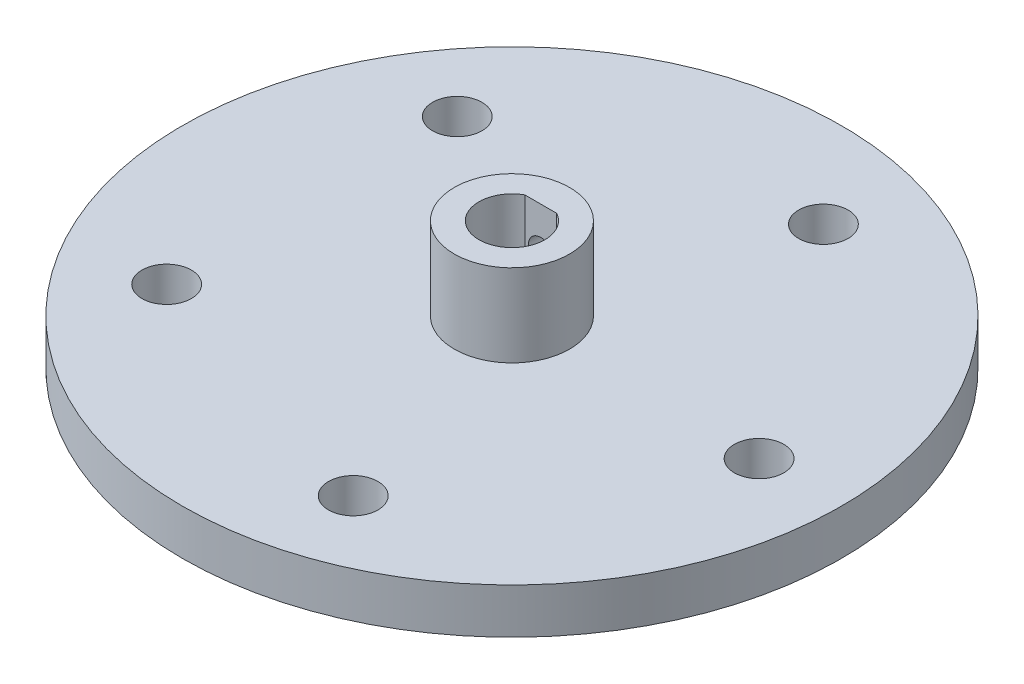
ISO-10303-21;
HEADER;
FILE_DESCRIPTION(('STEP AP214'),'2;1');
FILE_NAME('part.step','',(''),(''),'','','');
FILE_SCHEMA(('AUTOMOTIVE_DESIGN { 1 0 10303 214 1 1 1 1 }'));
ENDSEC;
DATA;
#1=APPLICATION_CONTEXT('core data for automotive mechanical design processes');
#2=APPLICATION_PROTOCOL_DEFINITION('international standard','automotive_design',2000,#1);
#3=PRODUCT_CONTEXT('',#1,'mechanical');
#4=PRODUCT('Part','Part','',(#3));
#5=PRODUCT_RELATED_PRODUCT_CATEGORY('part','',(#4));
#6=PRODUCT_DEFINITION_FORMATION('','',#4);
#7=PRODUCT_DEFINITION_CONTEXT('part definition',#1,'design');
#8=PRODUCT_DEFINITION('design','',#6,#7);
#9=PRODUCT_DEFINITION_SHAPE('','',#8);
#10=(LENGTH_UNIT() NAMED_UNIT(*) SI_UNIT(.MILLI.,.METRE.));
#11=(NAMED_UNIT(*) PLANE_ANGLE_UNIT() SI_UNIT($,.RADIAN.));
#12=(NAMED_UNIT(*) SI_UNIT($,.STERADIAN.) SOLID_ANGLE_UNIT());
#13=UNCERTAINTY_MEASURE_WITH_UNIT(LENGTH_MEASURE(1.E-05),#10,'distance_accuracy_value','');
#14=(GEOMETRIC_REPRESENTATION_CONTEXT(3) GLOBAL_UNCERTAINTY_ASSIGNED_CONTEXT((#13)) GLOBAL_UNIT_ASSIGNED_CONTEXT((#10,
#11,#12)) REPRESENTATION_CONTEXT('',''));
#15=CARTESIAN_POINT('',(0.,0.,0.));
#16=DIRECTION('',(0.,0.,1.));
#17=DIRECTION('',(1.,0.,0.));
#18=AXIS2_PLACEMENT_3D('',#15,#16,#17);
#19=CARTESIAN_POINT('',(0.,5.5,0.));
#20=DIRECTION('',(0.,-1.,0.));
#21=DIRECTION('',(0.,0.,-1.));
#22=AXIS2_PLACEMENT_3D('',#19,#20,#21);
#23=CYLINDRICAL_SURFACE('',#22,40.);
#24=CARTESIAN_POINT('',(0.,5.5,0.));
#25=DIRECTION('',(0.,1.,0.));
#26=DIRECTION('',(0.,0.,1.));
#27=AXIS2_PLACEMENT_3D('',#24,#25,#26);
#28=CIRCLE('',#27,40.);
#29=CARTESIAN_POINT('',(0.,5.5,40.));
#30=VERTEX_POINT('',#29);
#31=EDGE_CURVE('E11',#30,#30,#28,.T.);
#32=ORIENTED_EDGE('',*,*,#31,.F.);
#33=EDGE_LOOP('',(#32));
#34=FACE_BOUND('',#33,.T.);
#35=CARTESIAN_POINT('',(0.,0.,0.));
#36=DIRECTION('',(0.,1.,0.));
#37=DIRECTION('',(0.,0.,1.));
#38=AXIS2_PLACEMENT_3D('',#35,#36,#37);
#39=CIRCLE('',#38,40.);
#40=CARTESIAN_POINT('',(0.,0.,40.));
#41=VERTEX_POINT('',#40);
#42=EDGE_CURVE('E45',#41,#41,#39,.T.);
#43=ORIENTED_EDGE('',*,*,#42,.T.);
#44=EDGE_LOOP('',(#43));
#45=FACE_BOUND('',#44,.T.);
#46=ADVANCED_FACE('F37',(#34,#45),#23,.T.);
#47=CARTESIAN_POINT('',(0.,5.5,0.));
#48=DIRECTION('',(0.,1.,0.));
#49=DIRECTION('',(0.,0.,1.));
#50=AXIS2_PLACEMENT_3D('',#47,#48,#49);
#51=PLANE('',#50);
#52=CARTESIAN_POINT('',(0.,5.5,0.));
#53=DIRECTION('',(0.,1.,0.));
#54=DIRECTION('',(0.,0.,1.));
#55=AXIS2_PLACEMENT_3D('',#52,#53,#54);
#56=CIRCLE('',#55,7.);
#57=CARTESIAN_POINT('',(0.,5.5,7.));
#58=VERTEX_POINT('',#57);
#59=EDGE_CURVE('E92',#58,#58,#56,.T.);
#60=ORIENTED_EDGE('',*,*,#59,.F.);
#61=EDGE_LOOP('',(#60));
#62=FACE_BOUND('',#61,.T.);
#63=CARTESIAN_POINT('',(9.27050983124834,5.5,-28.5316954888546));
#64=DIRECTION('',(0.,1.,0.));
#65=DIRECTION('',(0.951056516295155,0.,0.309016994374945));
#66=AXIS2_PLACEMENT_3D('',#63,#64,#65);
#67=CIRCLE('',#66,3.);
#68=CARTESIAN_POINT('',(12.1236793801338,5.5,-27.6046445057298));
#69=VERTEX_POINT('',#68);
#70=EDGE_CURVE('E103',#69,#69,#67,.T.);
#71=ORIENTED_EDGE('',*,*,#70,.F.);
#72=EDGE_LOOP('',(#71));
#73=FACE_BOUND('',#72,.T.);
#74=CARTESIAN_POINT('',(-24.2705098312485,5.5,-17.6335575687741));
#75=DIRECTION('',(0.,1.,0.));
#76=DIRECTION('',(0.587785252292469,0.,-0.809016994374951));
#77=AXIS2_PLACEMENT_3D('',#74,#75,#76);
#78=CIRCLE('',#77,3.);
#79=CARTESIAN_POINT('',(-22.5071540743711,5.5,-20.0606085518989));
#80=VERTEX_POINT('',#79);
#81=EDGE_CURVE('E109',#80,#80,#78,.T.);
#82=ORIENTED_EDGE('',*,*,#81,.F.);
#83=EDGE_LOOP('',(#82));
#84=FACE_BOUND('',#83,.T.);
#85=CARTESIAN_POINT('',(-24.2705098312483,5.5,17.6335575687744));
#86=DIRECTION('',(0.,1.,0.));
#87=DIRECTION('',(-0.58778525229248,0.,-0.809016994374942));
#88=AXIS2_PLACEMENT_3D('',#85,#86,#87);
#89=CIRCLE('',#88,3.);
#90=CARTESIAN_POINT('',(-26.0338655881257,5.5,15.2065065856496));
#91=VERTEX_POINT('',#90);
#92=EDGE_CURVE('E115',#91,#91,#89,.T.);
#93=ORIENTED_EDGE('',*,*,#92,.F.);
#94=EDGE_LOOP('',(#93));
#95=FACE_BOUND('',#94,.T.);
#96=CARTESIAN_POINT('',(9.27050983124875,5.5,28.5316954888545));
#97=DIRECTION('',(0.,1.,0.));
#98=DIRECTION('',(-0.95105651629515,0.,0.309016994374958));
#99=AXIS2_PLACEMENT_3D('',#96,#97,#98);
#100=CIRCLE('',#99,3.);
#101=CARTESIAN_POINT('',(6.41734028236329,5.5,29.4587464719794));
#102=VERTEX_POINT('',#101);
#103=EDGE_CURVE('E96',#102,#102,#100,.T.);
#104=ORIENTED_EDGE('',*,*,#103,.F.);
#105=EDGE_LOOP('',(#104));
#106=FACE_BOUND('',#105,.T.);
#107=CARTESIAN_POINT('',(30.,5.5,0.));
#108=DIRECTION('',(0.,1.,0.));
#109=DIRECTION('',(0.,0.,1.));
#110=AXIS2_PLACEMENT_3D('',#107,#108,#109);
#111=CIRCLE('',#110,3.);
#112=CARTESIAN_POINT('',(30.,5.5,3.));
#113=VERTEX_POINT('',#112);
#114=EDGE_CURVE('E102',#113,#113,#111,.T.);
#115=ORIENTED_EDGE('',*,*,#114,.F.);
#116=EDGE_LOOP('',(#115));
#117=FACE_BOUND('',#116,.T.);
#118=ORIENTED_EDGE('',*,*,#31,.T.);
#119=EDGE_LOOP('',(#118));
#120=FACE_BOUND('',#119,.T.);
#121=ADVANCED_FACE('F134',(#62,#73,#84,#95,#106,#117,#120),#51,.T.);
#122=CARTESIAN_POINT('',(0.,0.,0.));
#123=DIRECTION('',(0.,1.,0.));
#124=DIRECTION('',(0.,0.,1.));
#125=AXIS2_PLACEMENT_3D('',#122,#123,#124);
#126=PLANE('',#125);
#127=CARTESIAN_POINT('',(0.,0.,0.));
#128=DIRECTION('',(0.,1.,0.));
#129=DIRECTION('',(0.,0.,1.));
#130=AXIS2_PLACEMENT_3D('',#127,#128,#129);
#131=CIRCLE('',#130,4.);
#132=CARTESIAN_POINT('',(-1.93649167310371,0.,-3.5));
#133=VERTEX_POINT('',#132);
#134=CARTESIAN_POINT('',(1.93649167310371,0.,-3.5));
#135=VERTEX_POINT('',#134);
#136=EDGE_CURVE('E69',#133,#135,#131,.T.);
#137=ORIENTED_EDGE('',*,*,#136,.T.);
#138=DIRECTION('',(-1.,0.,0.));
#139=VECTOR('',#138,1.);
#140=CARTESIAN_POINT('',(0.,0.,-3.5));
#141=LINE('',#140,#139);
#142=EDGE_CURVE('E67',#135,#133,#141,.T.);
#143=ORIENTED_EDGE('',*,*,#142,.T.);
#144=EDGE_LOOP('',(#137,#143));
#145=FACE_BOUND('',#144,.T.);
#146=CARTESIAN_POINT('',(9.27050983124834,0.,-28.5316954888546));
#147=DIRECTION('',(0.,1.,0.));
#148=DIRECTION('',(0.951056516295155,0.,0.309016994374945));
#149=AXIS2_PLACEMENT_3D('',#146,#147,#148);
#150=CIRCLE('',#149,3.);
#151=CARTESIAN_POINT('',(12.1236793801338,0.,-27.6046445057298));
#152=VERTEX_POINT('',#151);
#153=EDGE_CURVE('E99',#152,#152,#150,.T.);
#154=ORIENTED_EDGE('',*,*,#153,.T.);
#155=EDGE_LOOP('',(#154));
#156=FACE_BOUND('',#155,.T.);
#157=CARTESIAN_POINT('',(-24.2705098312485,0.,-17.6335575687741));
#158=DIRECTION('',(0.,1.,0.));
#159=DIRECTION('',(0.587785252292469,0.,-0.809016994374951));
#160=AXIS2_PLACEMENT_3D('',#157,#158,#159);
#161=CIRCLE('',#160,3.);
#162=CARTESIAN_POINT('',(-22.5071540743711,0.,-20.0606085518989));
#163=VERTEX_POINT('',#162);
#164=EDGE_CURVE('E106',#163,#163,#161,.T.);
#165=ORIENTED_EDGE('',*,*,#164,.T.);
#166=EDGE_LOOP('',(#165));
#167=FACE_BOUND('',#166,.T.);
#168=CARTESIAN_POINT('',(-24.2705098312483,0.,17.6335575687744));
#169=DIRECTION('',(0.,1.,0.));
#170=DIRECTION('',(-0.58778525229248,0.,-0.809016994374942));
#171=AXIS2_PLACEMENT_3D('',#168,#169,#170);
#172=CIRCLE('',#171,3.);
#173=CARTESIAN_POINT('',(-26.0338655881257,0.,15.2065065856496));
#174=VERTEX_POINT('',#173);
#175=EDGE_CURVE('E112',#174,#174,#172,.T.);
#176=ORIENTED_EDGE('',*,*,#175,.T.);
#177=EDGE_LOOP('',(#176));
#178=FACE_BOUND('',#177,.T.);
#179=CARTESIAN_POINT('',(9.27050983124875,0.,28.5316954888545));
#180=DIRECTION('',(0.,1.,0.));
#181=DIRECTION('',(-0.95105651629515,0.,0.309016994374958));
#182=AXIS2_PLACEMENT_3D('',#179,#180,#181);
#183=CIRCLE('',#182,3.);
#184=CARTESIAN_POINT('',(6.41734028236329,0.,29.4587464719794));
#185=VERTEX_POINT('',#184);
#186=EDGE_CURVE('E118',#185,#185,#183,.T.);
#187=ORIENTED_EDGE('',*,*,#186,.T.);
#188=EDGE_LOOP('',(#187));
#189=FACE_BOUND('',#188,.T.);
#190=CARTESIAN_POINT('',(30.,0.,0.));
#191=DIRECTION('',(0.,1.,0.));
#192=DIRECTION('',(0.,0.,1.));
#193=AXIS2_PLACEMENT_3D('',#190,#191,#192);
#194=CIRCLE('',#193,3.);
#195=CARTESIAN_POINT('',(30.,0.,3.));
#196=VERTEX_POINT('',#195);
#197=EDGE_CURVE('E123',#196,#196,#194,.T.);
#198=ORIENTED_EDGE('',*,*,#197,.T.);
#199=EDGE_LOOP('',(#198));
#200=FACE_BOUND('',#199,.T.);
#201=ORIENTED_EDGE('',*,*,#42,.F.);
#202=EDGE_LOOP('',(#201));
#203=FACE_BOUND('',#202,.T.);
#204=ADVANCED_FACE('F131',(#145,#156,#167,#178,#189,#200,#203),#126,.F.);
#205=CARTESIAN_POINT('',(30.,0.,0.));
#206=DIRECTION('',(0.,1.,0.));
#207=DIRECTION('',(0.,0.,1.));
#208=AXIS2_PLACEMENT_3D('',#205,#206,#207);
#209=CYLINDRICAL_SURFACE('',#208,3.);
#210=ORIENTED_EDGE('',*,*,#197,.F.);
#211=EDGE_LOOP('',(#210));
#212=FACE_BOUND('',#211,.T.);
#213=ORIENTED_EDGE('',*,*,#114,.T.);
#214=EDGE_LOOP('',(#213));
#215=FACE_BOUND('',#214,.T.);
#216=ADVANCED_FACE('F133',(#212,#215),#209,.F.);
#217=CARTESIAN_POINT('',(9.27050983124875,0.,28.5316954888545));
#218=DIRECTION('',(0.,1.,0.));
#219=DIRECTION('',(0.,0.,1.));
#220=AXIS2_PLACEMENT_3D('',#217,#218,#219);
#221=CYLINDRICAL_SURFACE('',#220,3.);
#222=ORIENTED_EDGE('',*,*,#186,.F.);
#223=EDGE_LOOP('',(#222));
#224=FACE_BOUND('',#223,.T.);
#225=ORIENTED_EDGE('',*,*,#103,.T.);
#226=EDGE_LOOP('',(#225));
#227=FACE_BOUND('',#226,.T.);
#228=ADVANCED_FACE('F140',(#224,#227),#221,.F.);
#229=CARTESIAN_POINT('',(-24.2705098312483,0.,17.6335575687744));
#230=DIRECTION('',(0.,1.,0.));
#231=DIRECTION('',(0.,0.,1.));
#232=AXIS2_PLACEMENT_3D('',#229,#230,#231);
#233=CYLINDRICAL_SURFACE('',#232,3.);
#234=ORIENTED_EDGE('',*,*,#175,.F.);
#235=EDGE_LOOP('',(#234));
#236=FACE_BOUND('',#235,.T.);
#237=ORIENTED_EDGE('',*,*,#92,.T.);
#238=EDGE_LOOP('',(#237));
#239=FACE_BOUND('',#238,.T.);
#240=ADVANCED_FACE('F225',(#236,#239),#233,.F.);
#241=CARTESIAN_POINT('',(-24.2705098312485,0.,-17.6335575687741));
#242=DIRECTION('',(0.,1.,0.));
#243=DIRECTION('',(0.,0.,1.));
#244=AXIS2_PLACEMENT_3D('',#241,#242,#243);
#245=CYLINDRICAL_SURFACE('',#244,3.);
#246=ORIENTED_EDGE('',*,*,#164,.F.);
#247=EDGE_LOOP('',(#246));
#248=FACE_BOUND('',#247,.T.);
#249=ORIENTED_EDGE('',*,*,#81,.T.);
#250=EDGE_LOOP('',(#249));
#251=FACE_BOUND('',#250,.T.);
#252=ADVANCED_FACE('F221',(#248,#251),#245,.F.);
#253=CARTESIAN_POINT('',(9.27050983124834,0.,-28.5316954888546));
#254=DIRECTION('',(0.,1.,0.));
#255=DIRECTION('',(0.,0.,1.));
#256=AXIS2_PLACEMENT_3D('',#253,#254,#255);
#257=CYLINDRICAL_SURFACE('',#256,3.);
#258=ORIENTED_EDGE('',*,*,#153,.F.);
#259=EDGE_LOOP('',(#258));
#260=FACE_BOUND('',#259,.T.);
#261=ORIENTED_EDGE('',*,*,#70,.T.);
#262=EDGE_LOOP('',(#261));
#263=FACE_BOUND('',#262,.T.);
#264=ADVANCED_FACE('F163',(#260,#263),#257,.F.);
#265=CARTESIAN_POINT('',(0.,15.5,0.));
#266=DIRECTION('',(0.,-1.,0.));
#267=DIRECTION('',(0.,0.,-1.));
#268=AXIS2_PLACEMENT_3D('',#265,#266,#267);
#269=CYLINDRICAL_SURFACE('',#268,7.);
#270=CARTESIAN_POINT('',(0.,12.,-7.));
#271=CARTESIAN_POINT('',(-0.0832358860906165,11.9999971004257,-6.99999846043226));
#272=CARTESIAN_POINT('',(-0.166507195600274,11.9930483916121,-6.9985002594971));
#273=CARTESIAN_POINT('',(-0.330687344293327,11.9654643431464,-6.99266829827728));
#274=CARTESIAN_POINT('',(-0.41159440357119,11.9448189558051,-6.98833245637099));
#275=CARTESIAN_POINT('',(-0.568649323817736,11.890515635392,-6.97730831788827));
#276=CARTESIAN_POINT('',(-0.644801963446555,11.8568710206187,-6.97062242967171));
#277=CARTESIAN_POINT('',(-0.790378177960787,11.7775659138287,-6.95562106817971));
#278=CARTESIAN_POINT('',(-0.859801981747369,11.7319058307501,-6.94730565036661));
#279=CARTESIAN_POINT('',(-0.991024790535229,11.6291197003265,-6.92981369246311));
#280=CARTESIAN_POINT('',(-1.05270503419445,11.5718437781015,-6.92062683143259));
#281=CARTESIAN_POINT('',(-1.16566042389435,11.4477736843148,-6.90250069814144));
#282=CARTESIAN_POINT('',(-1.21693467150908,11.3809786917487,-6.8935614473163));
#283=CARTESIAN_POINT('',(-1.30814204379808,11.2388942471396,-6.87684116047225));
#284=CARTESIAN_POINT('',(-1.34794958335009,11.1635224822438,-6.8690733634436));
#285=CARTESIAN_POINT('',(-1.41428823691148,11.0069655462332,-6.85572325558537));
#286=CARTESIAN_POINT('',(-1.44082087001716,10.9257810415074,-6.85014069470711));
#287=CARTESIAN_POINT('',(-1.47946574422454,10.7611889134119,-6.84189808926311));
#288=CARTESIAN_POINT('',(-1.49178779748342,10.6778327243361,-6.83919556896486));
#289=CARTESIAN_POINT('',(-1.50231395206577,10.510195767493,-6.83689139845106));
#290=CARTESIAN_POINT('',(-1.50051971664629,10.4259151098201,-6.83728938291729));
#291=CARTESIAN_POINT('',(-1.48303326340861,10.2603753120662,-6.84110276603832));
#292=CARTESIAN_POINT('',(-1.46758398649408,10.1790891108998,-6.84446541682162));
#293=CARTESIAN_POINT('',(-1.42361054298677,10.0202897597107,-6.85374593375788));
#294=CARTESIAN_POINT('',(-1.39508566936466,9.94277681396768,-6.85966393808402));
#295=CARTESIAN_POINT('',(-1.32554551075991,9.79303712712666,-6.87344080755724));
#296=CARTESIAN_POINT('',(-1.2844361097283,9.72085548728745,-6.88131420983365));
#297=CARTESIAN_POINT('',(-1.19096007283993,9.58432483504204,-6.89810572501288));
#298=CARTESIAN_POINT('',(-1.13859196103562,9.5199768513138,-6.90702397481896));
#299=CARTESIAN_POINT('',(-1.0227954275532,9.3995406443266,-6.92512718393878));
#300=CARTESIAN_POINT('',(-0.959160233964411,9.34365129341526,-6.93431383972178));
#301=CARTESIAN_POINT('',(-0.823317306269098,9.24330626631034,-6.95175017497059));
#302=CARTESIAN_POINT('',(-0.751109428775401,9.19885078139961,-6.95999983875972));
#303=CARTESIAN_POINT('',(-0.59993346204996,9.12258932009307,-6.97465778534003));
#304=CARTESIAN_POINT('',(-0.520952258863484,9.09080858742202,-6.98106238643354));
#305=CARTESIAN_POINT('',(-0.358603146685708,9.04102435167892,-6.99128109245334));
#306=CARTESIAN_POINT('',(-0.27523585113367,9.02301892743668,-6.99509555860384));
#307=CARTESIAN_POINT('',(-0.10818767083663,9.00158378585657,-6.99965306347808));
#308=CARTESIAN_POINT('',(-0.0245431772716156,8.99788228711822,-7.00045336521066));
#309=CARTESIAN_POINT('',(0.142168973650404,9.00442457112516,-6.99905248935969));
#310=CARTESIAN_POINT('',(0.225236668127254,9.01466744796294,-6.99685150675698));
#311=CARTESIAN_POINT('',(0.387542537982805,9.0485822436617,-6.98973143045266));
#312=CARTESIAN_POINT('',(0.466811712908476,9.07211236947253,-6.9848410504546));
#313=CARTESIAN_POINT('',(0.620278450473417,9.13177694299482,-6.9728892442151));
#314=CARTESIAN_POINT('',(0.694475592587739,9.16791243431165,-6.96582763822237));
#315=CARTESIAN_POINT('',(0.836821397964753,9.25233354306033,-6.950175043904));
#316=CARTESIAN_POINT('',(0.904872575111139,9.30077979490973,-6.94156431354275));
#317=CARTESIAN_POINT('',(1.03197692552359,9.40823482488873,-6.92381033034847));
#318=CARTESIAN_POINT('',(1.09102897869199,9.46724491588744,-6.91466701142097));
#319=CARTESIAN_POINT('',(1.19952711057989,9.59539737018713,-6.89668172706324));
#320=CARTESIAN_POINT('',(1.24878537255156,9.6647000992221,-6.88784792221285));
#321=CARTESIAN_POINT('',(1.3349641538604,9.81075459647799,-6.87166654559681));
#322=CARTESIAN_POINT('',(1.37188519913706,9.88750604697749,-6.86431891048055));
#323=CARTESIAN_POINT('',(1.43209741248548,10.0458722989946,-6.8520100980739));
#324=CARTESIAN_POINT('',(1.45546398641275,10.1274573564307,-6.84703574582967));
#325=CARTESIAN_POINT('',(1.48812696085335,10.2935155838336,-6.84001186708418));
#326=CARTESIAN_POINT('',(1.49742550780258,10.3779883112013,-6.83796189439706));
#327=CARTESIAN_POINT('',(1.5015999992604,10.5455323431752,-6.83704618848155));
#328=CARTESIAN_POINT('',(1.49677347258311,10.6285960149806,-6.83811476518543));
#329=CARTESIAN_POINT('',(1.47349789406331,10.7926972421326,-6.8431676318483));
#330=CARTESIAN_POINT('',(1.45504898957979,10.8737348193866,-6.84715189026714));
#331=CARTESIAN_POINT('',(1.40519345940434,11.0312586578692,-6.85755581104157));
#332=CARTESIAN_POINT('',(1.37382847170887,11.1077586486643,-6.86396764224703));
#333=CARTESIAN_POINT('',(1.29906751595601,11.2544553725068,-6.87850764590649));
#334=CARTESIAN_POINT('',(1.255670353015,11.324651478615,-6.88663598880363));
#335=CARTESIAN_POINT('',(1.15708290349304,11.4582181937254,-6.90389055593232));
#336=CARTESIAN_POINT('',(1.10167987421237,11.521429695947,-6.91303309938926));
#337=CARTESIAN_POINT('',(0.98108655461962,11.6377562625205,-6.93117449799694));
#338=CARTESIAN_POINT('',(0.915894009385597,11.6908689943122,-6.94017331951296));
#339=CARTESIAN_POINT('',(0.776603147268717,11.7861159595056,-6.95714491048987));
#340=CARTESIAN_POINT('',(0.702404846009642,11.828106606231,-6.96510364570626));
#341=CARTESIAN_POINT('',(0.547850160940599,11.8989545289062,-6.97895826104019));
#342=CARTESIAN_POINT('',(0.46749910586388,11.927823022585,-6.98485590212343));
#343=CARTESIAN_POINT('',(0.322535217553204,11.9663521851311,-6.99284848461772));
#344=CARTESIAN_POINT('',(0.258717205545979,11.97894643398,-6.99551391888263));
#345=CARTESIAN_POINT('',(0.129939960853846,11.9957713017117,-6.99909024154719));
#346=CARTESIAN_POINT('',(0.0649807750887447,12.0000022636461,-7.00000120191314));
#347=CARTESIAN_POINT('',(0.,12.,-7.));
#348=B_SPLINE_CURVE_WITH_KNOTS('',3,(#270,#271,#272,#273,#274,#275,#276,#277,#278,#279,#280,
#281,#282,#283,#284,#285,#286,#287,#288,#289,#290,#291,#292,#293,#294,#295,#296,#297,#298,#299,
#300,#301,#302,#303,#304,#305,#306,#307,#308,#309,#310,#311,#312,#313,#314,#315,#316,#317,#318,
#319,#320,#321,#322,#323,#324,#325,#326,#327,#328,#329,#330,#331,#332,#333,#334,#335,#336,#337,
#338,#339,#340,#341,#342,#343,#344,#345,#346,#347),.UNSPECIFIED.,.T.,.F.,(4,2,2,2,2,2,2,2,2,2,2,
2,2,2,2,2,2,2,2,2,2,2,2,2,2,2,2,2,2,2,2,2,2,2,2,2,2,2,4),(0.,0.249469836512081,
0.499122883219935,0.748520824425602,0.997910278645886,1.25074961881732,1.50361077918506,
1.7591442921451,2.0146485567749,2.26633008124666,2.51798195169165,2.76524475452927,
3.01252092904568,3.26169356165967,3.51089887920889,3.76527011050291,4.0196455970235,
4.27452521139806,4.52936927256343,4.77934665704185,5.02930780231429,5.27665060589267,
5.52401389198434,5.77478733867803,6.02559197304485,6.28082063283534,6.53603841075806,
6.78982240408475,7.04356767229185,7.29200680540294,7.5404432510827,7.78808499706785,
8.03575134451623,8.28822950154114,8.54076590397115,8.79641910357222,9.05185334010271,
9.24661799132294,9.44137465337336),.UNSPECIFIED.);
#349=CARTESIAN_POINT('',(0.,12.,-7.));
#350=VERTEX_POINT('',#349);
#351=EDGE_CURVE('E79',#350,#350,#348,.T.);
#352=ORIENTED_EDGE('',*,*,#351,.T.);
#353=EDGE_LOOP('',(#352));
#354=FACE_BOUND('',#353,.T.);
#355=CARTESIAN_POINT('',(0.,15.5,0.));
#356=DIRECTION('',(0.,1.,0.));
#357=DIRECTION('',(0.,0.,1.));
#358=AXIS2_PLACEMENT_3D('',#355,#356,#357);
#359=CIRCLE('',#358,7.);
#360=CARTESIAN_POINT('',(0.,15.5,7.));
#361=VERTEX_POINT('',#360);
#362=EDGE_CURVE('E93',#361,#361,#359,.T.);
#363=ORIENTED_EDGE('',*,*,#362,.F.);
#364=EDGE_LOOP('',(#363));
#365=FACE_BOUND('',#364,.T.);
#366=ORIENTED_EDGE('',*,*,#59,.T.);
#367=EDGE_LOOP('',(#366));
#368=FACE_BOUND('',#367,.T.);
#369=ADVANCED_FACE('F177',(#354,#365,#368),#269,.T.);
#370=CARTESIAN_POINT('',(0.,15.5,0.));
#371=DIRECTION('',(0.,1.,0.));
#372=DIRECTION('',(0.,0.,1.));
#373=AXIS2_PLACEMENT_3D('',#370,#371,#372);
#374=PLANE('',#373);
#375=DIRECTION('',(-1.,0.,0.));
#376=VECTOR('',#375,1.);
#377=CARTESIAN_POINT('',(0.,15.5,-3.5));
#378=LINE('',#377,#376);
#379=CARTESIAN_POINT('',(1.93649167310371,15.5,-3.5));
#380=VERTEX_POINT('',#379);
#381=CARTESIAN_POINT('',(-1.93649167310371,15.5,-3.5));
#382=VERTEX_POINT('',#381);
#383=EDGE_CURVE('E60',#380,#382,#378,.T.);
#384=ORIENTED_EDGE('',*,*,#383,.F.);
#385=CARTESIAN_POINT('',(0.,15.5,0.));
#386=DIRECTION('',(0.,1.,0.));
#387=DIRECTION('',(0.,0.,1.));
#388=AXIS2_PLACEMENT_3D('',#385,#386,#387);
#389=CIRCLE('',#388,4.);
#390=EDGE_CURVE('E73',#382,#380,#389,.T.);
#391=ORIENTED_EDGE('',*,*,#390,.F.);
#392=EDGE_LOOP('',(#384,#391));
#393=FACE_BOUND('',#392,.T.);
#394=ORIENTED_EDGE('',*,*,#362,.T.);
#395=EDGE_LOOP('',(#394));
#396=FACE_BOUND('',#395,.T.);
#397=ADVANCED_FACE('F77',(#393,#396),#374,.T.);
#398=CARTESIAN_POINT('',(0.,-4.5,-3.5));
#399=DIRECTION('',(0.,0.,-1.));
#400=DIRECTION('',(-1.,0.,0.));
#401=AXIS2_PLACEMENT_3D('',#398,#399,#400);
#402=PLANE('',#401);
#403=CARTESIAN_POINT('',(0.,10.5,-3.5));
#404=DIRECTION('',(0.,0.,-1.));
#405=DIRECTION('',(-1.,0.,0.));
#406=AXIS2_PLACEMENT_3D('',#403,#404,#405);
#407=CIRCLE('',#406,1.5);
#408=CARTESIAN_POINT('',(-1.5,10.5,-3.5));
#409=VERTEX_POINT('',#408);
#410=EDGE_CURVE('E40',#409,#409,#407,.T.);
#411=ORIENTED_EDGE('',*,*,#410,.T.);
#412=EDGE_LOOP('',(#411));
#413=FACE_BOUND('',#412,.T.);
#414=DIRECTION('',(0.,1.,0.));
#415=VECTOR('',#414,1.);
#416=CARTESIAN_POINT('',(1.93649167310371,-4.5,-3.5));
#417=LINE('',#416,#415);
#418=EDGE_CURVE('E53',#135,#380,#417,.T.);
#419=ORIENTED_EDGE('',*,*,#418,.T.);
#420=ORIENTED_EDGE('',*,*,#383,.T.);
#421=DIRECTION('',(0.,1.,0.));
#422=VECTOR('',#421,1.);
#423=CARTESIAN_POINT('',(-1.93649167310371,-4.5,-3.5));
#424=LINE('',#423,#422);
#425=EDGE_CURVE('E70',#133,#382,#424,.T.);
#426=ORIENTED_EDGE('',*,*,#425,.F.);
#427=ORIENTED_EDGE('',*,*,#142,.F.);
#428=EDGE_LOOP('',(#419,#420,#426,#427));
#429=FACE_BOUND('',#428,.T.);
#430=ADVANCED_FACE('F65',(#413,#429),#402,.F.);
#431=CARTESIAN_POINT('',(0.,-4.5,0.));
#432=DIRECTION('',(0.,1.,0.));
#433=DIRECTION('',(0.,0.,1.));
#434=AXIS2_PLACEMENT_3D('',#431,#432,#433);
#435=CYLINDRICAL_SURFACE('',#434,4.);
#436=ORIENTED_EDGE('',*,*,#425,.T.);
#437=ORIENTED_EDGE('',*,*,#390,.T.);
#438=ORIENTED_EDGE('',*,*,#418,.F.);
#439=ORIENTED_EDGE('',*,*,#136,.F.);
#440=EDGE_LOOP('',(#436,#437,#438,#439));
#441=FACE_BOUND('',#440,.T.);
#442=ADVANCED_FACE('F74',(#441),#435,.F.);
#443=CARTESIAN_POINT('',(0.,10.5,-10.));
#444=DIRECTION('',(0.,0.,1.));
#445=DIRECTION('',(1.,0.,0.));
#446=AXIS2_PLACEMENT_3D('',#443,#444,#445);
#447=CYLINDRICAL_SURFACE('',#446,1.5);
#448=ORIENTED_EDGE('',*,*,#410,.F.);
#449=EDGE_LOOP('',(#448));
#450=FACE_BOUND('',#449,.T.);
#451=ORIENTED_EDGE('',*,*,#351,.F.);
#452=EDGE_LOOP('',(#451));
#453=FACE_BOUND('',#452,.T.);
#454=ADVANCED_FACE('F190',(#450,#453),#447,.F.);
#455=CLOSED_SHELL('',(#46,#121,#204,#216,#228,#240,#252,#264,#369,#397,#430,#442,#454));
#456=MANIFOLD_SOLID_BREP('B2',#455);
#457=ADVANCED_BREP_SHAPE_REPRESENTATION('',(#18,#456),#14);
#458=SHAPE_DEFINITION_REPRESENTATION(#9,#457);
ENDSEC;
END-ISO-10303-21;
